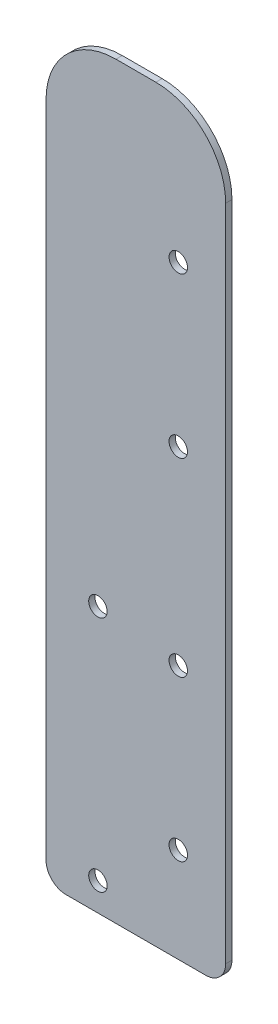
ISO-10303-21;
HEADER;
FILE_DESCRIPTION(('STEP AP214'),'2;1');
FILE_NAME('part.step','',(''),(''),'','','');
FILE_SCHEMA(('AUTOMOTIVE_DESIGN { 1 0 10303 214 1 1 1 1 }'));
ENDSEC;
DATA;
#1=APPLICATION_CONTEXT('core data for automotive mechanical design processes');
#2=APPLICATION_PROTOCOL_DEFINITION('international standard','automotive_design',2000,#1);
#3=PRODUCT_CONTEXT('',#1,'mechanical');
#4=PRODUCT('Part','Part','',(#3));
#5=PRODUCT_RELATED_PRODUCT_CATEGORY('part','',(#4));
#6=PRODUCT_DEFINITION_FORMATION('','',#4);
#7=PRODUCT_DEFINITION_CONTEXT('part definition',#1,'design');
#8=PRODUCT_DEFINITION('design','',#6,#7);
#9=PRODUCT_DEFINITION_SHAPE('','',#8);
#10=(LENGTH_UNIT() NAMED_UNIT(*) SI_UNIT(.MILLI.,.METRE.));
#11=(NAMED_UNIT(*) PLANE_ANGLE_UNIT() SI_UNIT($,.RADIAN.));
#12=(NAMED_UNIT(*) SI_UNIT($,.STERADIAN.) SOLID_ANGLE_UNIT());
#13=UNCERTAINTY_MEASURE_WITH_UNIT(LENGTH_MEASURE(1.E-05),#10,'distance_accuracy_value','');
#14=(GEOMETRIC_REPRESENTATION_CONTEXT(3) GLOBAL_UNCERTAINTY_ASSIGNED_CONTEXT((#13)) GLOBAL_UNIT_ASSIGNED_CONTEXT((#10,
#11,#12)) REPRESENTATION_CONTEXT('',''));
#15=CARTESIAN_POINT('',(0.,0.,0.));
#16=DIRECTION('',(0.,0.,1.));
#17=DIRECTION('',(1.,0.,0.));
#18=AXIS2_PLACEMENT_3D('',#15,#16,#17);
#19=CARTESIAN_POINT('',(40.64,5.07999999999999,1.6002));
#20=DIRECTION('',(0.,0.,1.));
#21=DIRECTION('',(1.,0.,0.));
#22=AXIS2_PLACEMENT_3D('',#19,#20,#21);
#23=PLANE('',#22);
#24=CARTESIAN_POINT('',(33.655,153.67,1.6002));
#25=DIRECTION('',(0.,0.,1.));
#26=DIRECTION('',(1.,0.,0.));
#27=AXIS2_PLACEMENT_3D('',#24,#25,#26);
#28=CIRCLE('',#27,2.3495);
#29=CARTESIAN_POINT('',(36.0045,153.67,1.6002));
#30=VERTEX_POINT('',#29);
#31=EDGE_CURVE('E211',#30,#30,#28,.T.);
#32=ORIENTED_EDGE('',*,*,#31,.F.);
#33=EDGE_LOOP('',(#32));
#34=FACE_BOUND('',#33,.T.);
#35=CARTESIAN_POINT('',(13.208,7.15102725040235,1.6002));
#36=DIRECTION('',(0.,0.,1.));
#37=DIRECTION('',(1.,0.,0.));
#38=AXIS2_PLACEMENT_3D('',#35,#36,#37);
#39=CIRCLE('',#38,2.3495);
#40=CARTESIAN_POINT('',(15.5575,7.15102725040235,1.6002));
#41=VERTEX_POINT('',#40);
#42=EDGE_CURVE('E199',#41,#41,#39,.T.);
#43=ORIENTED_EDGE('',*,*,#42,.F.);
#44=EDGE_LOOP('',(#43));
#45=FACE_BOUND('',#44,.T.);
#46=CARTESIAN_POINT('',(33.655,24.13,1.6002));
#47=DIRECTION('',(0.,0.,1.));
#48=DIRECTION('',(1.,0.,0.));
#49=AXIS2_PLACEMENT_3D('',#46,#47,#48);
#50=CIRCLE('',#49,2.34949999999999);
#51=CARTESIAN_POINT('',(36.0045,24.13,1.6002));
#52=VERTEX_POINT('',#51);
#53=EDGE_CURVE('E142',#52,#52,#50,.T.);
#54=ORIENTED_EDGE('',*,*,#53,.F.);
#55=EDGE_LOOP('',(#54));
#56=FACE_BOUND('',#55,.T.);
#57=DIRECTION('',(1.,0.,0.));
#58=VECTOR('',#57,1.);
#59=CARTESIAN_POINT('',(5.07001431390806,0.,1.6002));
#60=LINE('',#59,#58);
#61=CARTESIAN_POINT('',(5.07001431390807,0.,1.6002));
#62=VERTEX_POINT('',#61);
#63=CARTESIAN_POINT('',(40.64,0.,1.6002));
#64=VERTEX_POINT('',#63);
#65=EDGE_CURVE('E102',#62,#64,#60,.T.);
#66=ORIENTED_EDGE('',*,*,#65,.T.);
#67=CARTESIAN_POINT('',(40.64,5.07999999999999,1.6002));
#68=DIRECTION('',(0.,0.,1.));
#69=DIRECTION('',(1.,0.,0.));
#70=AXIS2_PLACEMENT_3D('',#67,#68,#69);
#71=CIRCLE('',#70,5.08);
#72=CARTESIAN_POINT('',(45.72,5.07999999999999,1.6002));
#73=VERTEX_POINT('',#72);
#74=EDGE_CURVE('E187',#64,#73,#71,.T.);
#75=ORIENTED_EDGE('',*,*,#74,.T.);
#76=DIRECTION('',(0.,1.,0.));
#77=VECTOR('',#76,1.);
#78=CARTESIAN_POINT('',(45.72,5.07999999999999,1.6002));
#79=LINE('',#78,#77);
#80=CARTESIAN_POINT('',(45.72,172.72,1.6002));
#81=VERTEX_POINT('',#80);
#82=EDGE_CURVE('E170',#73,#81,#79,.T.);
#83=ORIENTED_EDGE('',*,*,#82,.T.);
#84=CARTESIAN_POINT('',(27.94,172.72,1.6002));
#85=DIRECTION('',(0.,0.,1.));
#86=DIRECTION('',(1.,0.,0.));
#87=AXIS2_PLACEMENT_3D('',#84,#85,#86);
#88=CIRCLE('',#87,17.78);
#89=CARTESIAN_POINT('',(27.94,190.5,1.6002));
#90=VERTEX_POINT('',#89);
#91=EDGE_CURVE('E183',#81,#90,#88,.T.);
#92=ORIENTED_EDGE('',*,*,#91,.T.);
#93=DIRECTION('',(-1.,0.,0.));
#94=VECTOR('',#93,1.);
#95=CARTESIAN_POINT('',(17.78,190.5,1.6002));
#96=LINE('',#95,#94);
#97=CARTESIAN_POINT('',(17.78,190.5,1.6002));
#98=VERTEX_POINT('',#97);
#99=EDGE_CURVE('E122',#90,#98,#96,.T.);
#100=ORIENTED_EDGE('',*,*,#99,.T.);
#101=CARTESIAN_POINT('',(17.78,172.72,1.6002));
#102=DIRECTION('',(0.,0.,1.));
#103=DIRECTION('',(-1.,0.,0.));
#104=AXIS2_PLACEMENT_3D('',#101,#102,#103);
#105=CIRCLE('',#104,17.78);
#106=CARTESIAN_POINT('',(0.,172.72,1.6002));
#107=VERTEX_POINT('',#106);
#108=EDGE_CURVE('E116',#98,#107,#105,.T.);
#109=ORIENTED_EDGE('',*,*,#108,.T.);
#110=DIRECTION('',(0.,-1.,0.));
#111=VECTOR('',#110,1.);
#112=CARTESIAN_POINT('',(0.,4.76163722458914,1.6002));
#113=LINE('',#112,#111);
#114=CARTESIAN_POINT('',(0.,4.76163722458914,1.6002));
#115=VERTEX_POINT('',#114);
#116=EDGE_CURVE('E120',#107,#115,#113,.T.);
#117=ORIENTED_EDGE('',*,*,#116,.T.);
#118=CARTESIAN_POINT('',(5.07001431390807,5.08,1.6002));
#119=DIRECTION('',(0.,0.,1.));
#120=DIRECTION('',(-1.,0.,0.));
#121=AXIS2_PLACEMENT_3D('',#118,#119,#120);
#122=CIRCLE('',#121,5.08);
#123=EDGE_CURVE('E60',#115,#62,#122,.T.);
#124=ORIENTED_EDGE('',*,*,#123,.T.);
#125=EDGE_LOOP('',(#66,#75,#83,#92,#100,#109,#117,#124));
#126=FACE_BOUND('',#125,.T.);
#127=CARTESIAN_POINT('',(33.655,64.77,1.6002));
#128=DIRECTION('',(0.,0.,1.));
#129=DIRECTION('',(1.,0.,0.));
#130=AXIS2_PLACEMENT_3D('',#127,#128,#129);
#131=CIRCLE('',#130,2.34949999999999);
#132=CARTESIAN_POINT('',(36.0045,64.77,1.6002));
#133=VERTEX_POINT('',#132);
#134=EDGE_CURVE('E193',#133,#133,#131,.T.);
#135=ORIENTED_EDGE('',*,*,#134,.F.);
#136=EDGE_LOOP('',(#135));
#137=FACE_BOUND('',#136,.T.);
#138=CARTESIAN_POINT('',(33.655,113.03,1.6002));
#139=DIRECTION('',(0.,0.,1.));
#140=DIRECTION('',(1.,0.,0.));
#141=AXIS2_PLACEMENT_3D('',#138,#139,#140);
#142=CIRCLE('',#141,2.34949999999999);
#143=CARTESIAN_POINT('',(36.0045,113.03,1.6002));
#144=VERTEX_POINT('',#143);
#145=EDGE_CURVE('E205',#144,#144,#142,.T.);
#146=ORIENTED_EDGE('',*,*,#145,.F.);
#147=EDGE_LOOP('',(#146));
#148=FACE_BOUND('',#147,.T.);
#149=CARTESIAN_POINT('',(13.208,67.6031372950225,1.6002));
#150=DIRECTION('',(0.,0.,1.));
#151=DIRECTION('',(1.,0.,0.));
#152=AXIS2_PLACEMENT_3D('',#149,#150,#151);
#153=CIRCLE('',#152,2.3495);
#154=CARTESIAN_POINT('',(15.5575,67.6031372950225,1.6002));
#155=VERTEX_POINT('',#154);
#156=EDGE_CURVE('E217',#155,#155,#153,.T.);
#157=ORIENTED_EDGE('',*,*,#156,.F.);
#158=EDGE_LOOP('',(#157));
#159=FACE_BOUND('',#158,.T.);
#160=ADVANCED_FACE('F43',(#34,#45,#56,#126,#137,#148,#159),#23,.T.);
#161=CARTESIAN_POINT('',(40.64,5.07999999999999,0.));
#162=DIRECTION('',(0.,0.,1.));
#163=DIRECTION('',(1.,0.,0.));
#164=AXIS2_PLACEMENT_3D('',#161,#162,#163);
#165=PLANE('',#164);
#166=DIRECTION('',(1.,0.,0.));
#167=VECTOR('',#166,1.);
#168=CARTESIAN_POINT('',(40.64,0.,0.));
#169=LINE('',#168,#167);
#170=CARTESIAN_POINT('',(5.07001431390807,0.,0.));
#171=VERTEX_POINT('',#170);
#172=CARTESIAN_POINT('',(40.64,0.,0.));
#173=VERTEX_POINT('',#172);
#174=EDGE_CURVE('E96',#171,#173,#169,.T.);
#175=ORIENTED_EDGE('',*,*,#174,.F.);
#176=CARTESIAN_POINT('',(5.07001431390807,5.08,0.));
#177=DIRECTION('',(0.,0.,1.));
#178=DIRECTION('',(-1.,0.,0.));
#179=AXIS2_PLACEMENT_3D('',#176,#177,#178);
#180=CIRCLE('',#179,5.08);
#181=CARTESIAN_POINT('',(0.,4.76163722458914,0.));
#182=VERTEX_POINT('',#181);
#183=EDGE_CURVE('E152',#182,#171,#180,.T.);
#184=ORIENTED_EDGE('',*,*,#183,.F.);
#185=DIRECTION('',(0.,-1.,0.));
#186=VECTOR('',#185,1.);
#187=CARTESIAN_POINT('',(0.,4.76163722458914,0.));
#188=LINE('',#187,#186);
#189=CARTESIAN_POINT('',(0.,172.72,0.));
#190=VERTEX_POINT('',#189);
#191=EDGE_CURVE('E89',#190,#182,#188,.T.);
#192=ORIENTED_EDGE('',*,*,#191,.F.);
#193=CARTESIAN_POINT('',(17.78,172.72,0.));
#194=DIRECTION('',(0.,0.,1.));
#195=DIRECTION('',(-1.,0.,0.));
#196=AXIS2_PLACEMENT_3D('',#193,#194,#195);
#197=CIRCLE('',#196,17.78);
#198=CARTESIAN_POINT('',(17.78,190.5,0.));
#199=VERTEX_POINT('',#198);
#200=EDGE_CURVE('E130',#199,#190,#197,.T.);
#201=ORIENTED_EDGE('',*,*,#200,.F.);
#202=DIRECTION('',(-1.,0.,0.));
#203=VECTOR('',#202,1.);
#204=CARTESIAN_POINT('',(17.78,190.5,0.));
#205=LINE('',#204,#203);
#206=CARTESIAN_POINT('',(27.94,190.5,0.));
#207=VERTEX_POINT('',#206);
#208=EDGE_CURVE('E148',#207,#199,#205,.T.);
#209=ORIENTED_EDGE('',*,*,#208,.F.);
#210=CARTESIAN_POINT('',(27.94,172.72,0.));
#211=DIRECTION('',(0.,0.,1.));
#212=DIRECTION('',(1.,0.,0.));
#213=AXIS2_PLACEMENT_3D('',#210,#211,#212);
#214=CIRCLE('',#213,17.78);
#215=CARTESIAN_POINT('',(45.72,172.72,0.));
#216=VERTEX_POINT('',#215);
#217=EDGE_CURVE('E146',#216,#207,#214,.T.);
#218=ORIENTED_EDGE('',*,*,#217,.F.);
#219=DIRECTION('',(0.,1.,0.));
#220=VECTOR('',#219,1.);
#221=CARTESIAN_POINT('',(45.72,5.07999999999999,0.));
#222=LINE('',#221,#220);
#223=CARTESIAN_POINT('',(45.72,5.07999999999999,0.));
#224=VERTEX_POINT('',#223);
#225=EDGE_CURVE('E144',#224,#216,#222,.T.);
#226=ORIENTED_EDGE('',*,*,#225,.F.);
#227=CARTESIAN_POINT('',(40.64,5.07999999999999,0.));
#228=DIRECTION('',(0.,0.,1.));
#229=DIRECTION('',(1.,0.,0.));
#230=AXIS2_PLACEMENT_3D('',#227,#228,#229);
#231=CIRCLE('',#230,5.08);
#232=EDGE_CURVE('E141',#173,#224,#231,.T.);
#233=ORIENTED_EDGE('',*,*,#232,.F.);
#234=EDGE_LOOP('',(#175,#184,#192,#201,#209,#218,#226,#233));
#235=FACE_BOUND('',#234,.T.);
#236=CARTESIAN_POINT('',(33.655,24.13,0.));
#237=DIRECTION('',(0.,0.,1.));
#238=DIRECTION('',(1.,0.,0.));
#239=AXIS2_PLACEMENT_3D('',#236,#237,#238);
#240=CIRCLE('',#239,2.34949999999999);
#241=CARTESIAN_POINT('',(36.0045,24.13,0.));
#242=VERTEX_POINT('',#241);
#243=EDGE_CURVE('E190',#242,#242,#240,.T.);
#244=ORIENTED_EDGE('',*,*,#243,.T.);
#245=EDGE_LOOP('',(#244));
#246=FACE_BOUND('',#245,.T.);
#247=CARTESIAN_POINT('',(33.655,64.77,0.));
#248=DIRECTION('',(0.,0.,1.));
#249=DIRECTION('',(1.,0.,0.));
#250=AXIS2_PLACEMENT_3D('',#247,#248,#249);
#251=CIRCLE('',#250,2.34949999999999);
#252=CARTESIAN_POINT('',(36.0045,64.77,0.));
#253=VERTEX_POINT('',#252);
#254=EDGE_CURVE('E196',#253,#253,#251,.T.);
#255=ORIENTED_EDGE('',*,*,#254,.T.);
#256=EDGE_LOOP('',(#255));
#257=FACE_BOUND('',#256,.T.);
#258=CARTESIAN_POINT('',(13.208,7.15102725040235,0.));
#259=DIRECTION('',(0.,0.,1.));
#260=DIRECTION('',(1.,0.,0.));
#261=AXIS2_PLACEMENT_3D('',#258,#259,#260);
#262=CIRCLE('',#261,2.3495);
#263=CARTESIAN_POINT('',(15.5575,7.15102725040235,0.));
#264=VERTEX_POINT('',#263);
#265=EDGE_CURVE('E202',#264,#264,#262,.T.);
#266=ORIENTED_EDGE('',*,*,#265,.T.);
#267=EDGE_LOOP('',(#266));
#268=FACE_BOUND('',#267,.T.);
#269=CARTESIAN_POINT('',(33.655,113.03,0.));
#270=DIRECTION('',(0.,0.,1.));
#271=DIRECTION('',(1.,0.,0.));
#272=AXIS2_PLACEMENT_3D('',#269,#270,#271);
#273=CIRCLE('',#272,2.34949999999999);
#274=CARTESIAN_POINT('',(36.0045,113.03,0.));
#275=VERTEX_POINT('',#274);
#276=EDGE_CURVE('E208',#275,#275,#273,.T.);
#277=ORIENTED_EDGE('',*,*,#276,.T.);
#278=EDGE_LOOP('',(#277));
#279=FACE_BOUND('',#278,.T.);
#280=CARTESIAN_POINT('',(33.655,153.67,0.));
#281=DIRECTION('',(0.,0.,1.));
#282=DIRECTION('',(1.,0.,0.));
#283=AXIS2_PLACEMENT_3D('',#280,#281,#282);
#284=CIRCLE('',#283,2.3495);
#285=CARTESIAN_POINT('',(36.0045,153.67,0.));
#286=VERTEX_POINT('',#285);
#287=EDGE_CURVE('E214',#286,#286,#284,.T.);
#288=ORIENTED_EDGE('',*,*,#287,.T.);
#289=EDGE_LOOP('',(#288));
#290=FACE_BOUND('',#289,.T.);
#291=CARTESIAN_POINT('',(13.208,67.6031372950225,0.));
#292=DIRECTION('',(0.,0.,1.));
#293=DIRECTION('',(1.,0.,0.));
#294=AXIS2_PLACEMENT_3D('',#291,#292,#293);
#295=CIRCLE('',#294,2.3495);
#296=CARTESIAN_POINT('',(15.5575,67.6031372950225,0.));
#297=VERTEX_POINT('',#296);
#298=EDGE_CURVE('E220',#297,#297,#295,.T.);
#299=ORIENTED_EDGE('',*,*,#298,.T.);
#300=EDGE_LOOP('',(#299));
#301=FACE_BOUND('',#300,.T.);
#302=ADVANCED_FACE('F174',(#235,#246,#257,#268,#279,#290,#301),#165,.F.);
#303=CARTESIAN_POINT('',(40.64,0.,1.6002));
#304=DIRECTION('',(0.,1.,0.));
#305=DIRECTION('',(-1.,0.,0.));
#306=AXIS2_PLACEMENT_3D('',#303,#304,#305);
#307=PLANE('',#306);
#308=ORIENTED_EDGE('',*,*,#174,.T.);
#309=DIRECTION('',(0.,0.,-1.));
#310=VECTOR('',#309,1.);
#311=CARTESIAN_POINT('',(40.64,0.,1.6002));
#312=LINE('',#311,#310);
#313=EDGE_CURVE('E11',#64,#173,#312,.T.);
#314=ORIENTED_EDGE('',*,*,#313,.F.);
#315=ORIENTED_EDGE('',*,*,#65,.F.);
#316=DIRECTION('',(0.,0.,-1.));
#317=VECTOR('',#316,1.);
#318=CARTESIAN_POINT('',(5.07001431390807,0.,1.6002));
#319=LINE('',#318,#317);
#320=EDGE_CURVE('E136',#62,#171,#319,.T.);
#321=ORIENTED_EDGE('',*,*,#320,.T.);
#322=EDGE_LOOP('',(#308,#314,#315,#321));
#323=FACE_BOUND('',#322,.T.);
#324=ADVANCED_FACE('F45',(#323),#307,.F.);
#325=CARTESIAN_POINT('',(40.64,5.07999999999999,1.6002));
#326=DIRECTION('',(0.,0.,-1.));
#327=DIRECTION('',(-1.,0.,0.));
#328=AXIS2_PLACEMENT_3D('',#325,#326,#327);
#329=CYLINDRICAL_SURFACE('',#328,5.08);
#330=ORIENTED_EDGE('',*,*,#232,.T.);
#331=DIRECTION('',(0.,0.,-1.));
#332=VECTOR('',#331,1.);
#333=CARTESIAN_POINT('',(45.72,5.07999999999999,1.6002));
#334=LINE('',#333,#332);
#335=EDGE_CURVE('E52',#73,#224,#334,.T.);
#336=ORIENTED_EDGE('',*,*,#335,.F.);
#337=ORIENTED_EDGE('',*,*,#74,.F.);
#338=ORIENTED_EDGE('',*,*,#313,.T.);
#339=EDGE_LOOP('',(#330,#336,#337,#338));
#340=FACE_BOUND('',#339,.T.);
#341=ADVANCED_FACE('F255',(#340),#329,.T.);
#342=CARTESIAN_POINT('',(45.72,5.07999999999999,1.6002));
#343=DIRECTION('',(-1.,0.,0.));
#344=DIRECTION('',(0.,-1.,0.));
#345=AXIS2_PLACEMENT_3D('',#342,#343,#344);
#346=PLANE('',#345);
#347=ORIENTED_EDGE('',*,*,#225,.T.);
#348=DIRECTION('',(0.,0.,-1.));
#349=VECTOR('',#348,1.);
#350=CARTESIAN_POINT('',(45.72,172.72,1.6002));
#351=LINE('',#350,#349);
#352=EDGE_CURVE('E161',#81,#216,#351,.T.);
#353=ORIENTED_EDGE('',*,*,#352,.F.);
#354=ORIENTED_EDGE('',*,*,#82,.F.);
#355=ORIENTED_EDGE('',*,*,#335,.T.);
#356=EDGE_LOOP('',(#347,#353,#354,#355));
#357=FACE_BOUND('',#356,.T.);
#358=ADVANCED_FACE('F168',(#357),#346,.F.);
#359=CARTESIAN_POINT('',(27.94,172.72,1.6002));
#360=DIRECTION('',(0.,0.,-1.));
#361=DIRECTION('',(-1.,0.,0.));
#362=AXIS2_PLACEMENT_3D('',#359,#360,#361);
#363=CYLINDRICAL_SURFACE('',#362,17.78);
#364=ORIENTED_EDGE('',*,*,#217,.T.);
#365=DIRECTION('',(0.,0.,-1.));
#366=VECTOR('',#365,1.);
#367=CARTESIAN_POINT('',(27.94,190.5,1.6002));
#368=LINE('',#367,#366);
#369=EDGE_CURVE('E158',#90,#207,#368,.T.);
#370=ORIENTED_EDGE('',*,*,#369,.F.);
#371=ORIENTED_EDGE('',*,*,#91,.F.);
#372=ORIENTED_EDGE('',*,*,#352,.T.);
#373=EDGE_LOOP('',(#364,#370,#371,#372));
#374=FACE_BOUND('',#373,.T.);
#375=ADVANCED_FACE('F179',(#374),#363,.T.);
#376=CARTESIAN_POINT('',(17.78,190.5,1.6002));
#377=DIRECTION('',(0.,-1.,0.));
#378=DIRECTION('',(0.,0.,-1.));
#379=AXIS2_PLACEMENT_3D('',#376,#377,#378);
#380=PLANE('',#379);
#381=ORIENTED_EDGE('',*,*,#208,.T.);
#382=DIRECTION('',(0.,0.,-1.));
#383=VECTOR('',#382,1.);
#384=CARTESIAN_POINT('',(17.78,190.5,1.6002));
#385=LINE('',#384,#383);
#386=EDGE_CURVE('E131',#98,#199,#385,.T.);
#387=ORIENTED_EDGE('',*,*,#386,.F.);
#388=ORIENTED_EDGE('',*,*,#99,.F.);
#389=ORIENTED_EDGE('',*,*,#369,.T.);
#390=EDGE_LOOP('',(#381,#387,#388,#389));
#391=FACE_BOUND('',#390,.T.);
#392=ADVANCED_FACE('F182',(#391),#380,.F.);
#393=CARTESIAN_POINT('',(17.78,172.72,1.6002));
#394=DIRECTION('',(0.,0.,-1.));
#395=DIRECTION('',(-1.,0.,0.));
#396=AXIS2_PLACEMENT_3D('',#393,#394,#395);
#397=CYLINDRICAL_SURFACE('',#396,17.78);
#398=ORIENTED_EDGE('',*,*,#200,.T.);
#399=DIRECTION('',(0.,0.,-1.));
#400=VECTOR('',#399,1.);
#401=CARTESIAN_POINT('',(0.,172.72,1.6002));
#402=LINE('',#401,#400);
#403=EDGE_CURVE('E127',#107,#190,#402,.T.);
#404=ORIENTED_EDGE('',*,*,#403,.F.);
#405=ORIENTED_EDGE('',*,*,#108,.F.);
#406=ORIENTED_EDGE('',*,*,#386,.T.);
#407=EDGE_LOOP('',(#398,#404,#405,#406));
#408=FACE_BOUND('',#407,.T.);
#409=ADVANCED_FACE('F128',(#408),#397,.T.);
#410=CARTESIAN_POINT('',(0.,4.76163722458914,1.6002));
#411=DIRECTION('',(1.,0.,0.));
#412=DIRECTION('',(0.,0.,-1.));
#413=AXIS2_PLACEMENT_3D('',#410,#411,#412);
#414=PLANE('',#413);
#415=ORIENTED_EDGE('',*,*,#191,.T.);
#416=DIRECTION('',(0.,0.,-1.));
#417=VECTOR('',#416,1.);
#418=CARTESIAN_POINT('',(0.,4.76163722458914,1.6002));
#419=LINE('',#418,#417);
#420=EDGE_CURVE('E132',#115,#182,#419,.T.);
#421=ORIENTED_EDGE('',*,*,#420,.F.);
#422=ORIENTED_EDGE('',*,*,#116,.F.);
#423=ORIENTED_EDGE('',*,*,#403,.T.);
#424=EDGE_LOOP('',(#415,#421,#422,#423));
#425=FACE_BOUND('',#424,.T.);
#426=ADVANCED_FACE('F134',(#425),#414,.F.);
#427=CARTESIAN_POINT('',(5.07001431390807,5.08,1.6002));
#428=DIRECTION('',(0.,0.,-1.));
#429=DIRECTION('',(-1.,0.,0.));
#430=AXIS2_PLACEMENT_3D('',#427,#428,#429);
#431=CYLINDRICAL_SURFACE('',#430,5.08);
#432=ORIENTED_EDGE('',*,*,#183,.T.);
#433=ORIENTED_EDGE('',*,*,#320,.F.);
#434=ORIENTED_EDGE('',*,*,#123,.F.);
#435=ORIENTED_EDGE('',*,*,#420,.T.);
#436=EDGE_LOOP('',(#432,#433,#434,#435));
#437=FACE_BOUND('',#436,.T.);
#438=ADVANCED_FACE('F242',(#437),#431,.T.);
#439=CARTESIAN_POINT('',(33.655,24.13,1.6002));
#440=DIRECTION('',(0.,0.,-1.));
#441=DIRECTION('',(-1.,0.,0.));
#442=AXIS2_PLACEMENT_3D('',#439,#440,#441);
#443=CYLINDRICAL_SURFACE('',#442,2.34949999999999);
#444=ORIENTED_EDGE('',*,*,#53,.T.);
#445=EDGE_LOOP('',(#444));
#446=FACE_BOUND('',#445,.T.);
#447=ORIENTED_EDGE('',*,*,#243,.F.);
#448=EDGE_LOOP('',(#447));
#449=FACE_BOUND('',#448,.T.);
#450=ADVANCED_FACE('F239',(#446,#449),#443,.F.);
#451=CARTESIAN_POINT('',(33.655,64.77,1.6002));
#452=DIRECTION('',(0.,0.,-1.));
#453=DIRECTION('',(-1.,0.,0.));
#454=AXIS2_PLACEMENT_3D('',#451,#452,#453);
#455=CYLINDRICAL_SURFACE('',#454,2.34949999999999);
#456=ORIENTED_EDGE('',*,*,#134,.T.);
#457=EDGE_LOOP('',(#456));
#458=FACE_BOUND('',#457,.T.);
#459=ORIENTED_EDGE('',*,*,#254,.F.);
#460=EDGE_LOOP('',(#459));
#461=FACE_BOUND('',#460,.T.);
#462=ADVANCED_FACE('F319',(#458,#461),#455,.F.);
#463=CARTESIAN_POINT('',(13.208,7.15102725040235,1.6002));
#464=DIRECTION('',(0.,0.,-1.));
#465=DIRECTION('',(-1.,0.,0.));
#466=AXIS2_PLACEMENT_3D('',#463,#464,#465);
#467=CYLINDRICAL_SURFACE('',#466,2.3495);
#468=ORIENTED_EDGE('',*,*,#42,.T.);
#469=EDGE_LOOP('',(#468));
#470=FACE_BOUND('',#469,.T.);
#471=ORIENTED_EDGE('',*,*,#265,.F.);
#472=EDGE_LOOP('',(#471));
#473=FACE_BOUND('',#472,.T.);
#474=ADVANCED_FACE('F327',(#470,#473),#467,.F.);
#475=CARTESIAN_POINT('',(33.655,113.03,1.6002));
#476=DIRECTION('',(0.,0.,-1.));
#477=DIRECTION('',(-1.,0.,0.));
#478=AXIS2_PLACEMENT_3D('',#475,#476,#477);
#479=CYLINDRICAL_SURFACE('',#478,2.34949999999999);
#480=ORIENTED_EDGE('',*,*,#145,.T.);
#481=EDGE_LOOP('',(#480));
#482=FACE_BOUND('',#481,.T.);
#483=ORIENTED_EDGE('',*,*,#276,.F.);
#484=EDGE_LOOP('',(#483));
#485=FACE_BOUND('',#484,.T.);
#486=ADVANCED_FACE('F335',(#482,#485),#479,.F.);
#487=CARTESIAN_POINT('',(33.655,153.67,1.6002));
#488=DIRECTION('',(0.,0.,-1.));
#489=DIRECTION('',(-1.,0.,0.));
#490=AXIS2_PLACEMENT_3D('',#487,#488,#489);
#491=CYLINDRICAL_SURFACE('',#490,2.3495);
#492=ORIENTED_EDGE('',*,*,#31,.T.);
#493=EDGE_LOOP('',(#492));
#494=FACE_BOUND('',#493,.T.);
#495=ORIENTED_EDGE('',*,*,#287,.F.);
#496=EDGE_LOOP('',(#495));
#497=FACE_BOUND('',#496,.T.);
#498=ADVANCED_FACE('F344',(#494,#497),#491,.F.);
#499=CARTESIAN_POINT('',(13.208,67.6031372950225,1.6002));
#500=DIRECTION('',(0.,0.,-1.));
#501=DIRECTION('',(-1.,0.,0.));
#502=AXIS2_PLACEMENT_3D('',#499,#500,#501);
#503=CYLINDRICAL_SURFACE('',#502,2.3495);
#504=ORIENTED_EDGE('',*,*,#156,.T.);
#505=EDGE_LOOP('',(#504));
#506=FACE_BOUND('',#505,.T.);
#507=ORIENTED_EDGE('',*,*,#298,.F.);
#508=EDGE_LOOP('',(#507));
#509=FACE_BOUND('',#508,.T.);
#510=ADVANCED_FACE('F226',(#506,#509),#503,.F.);
#511=CLOSED_SHELL('',(#160,#302,#324,#341,#358,#375,#392,#409,#426,#438,#450,#462,#474,#486,
#498,#510));
#512=MANIFOLD_SOLID_BREP('B2',#511);
#513=ADVANCED_BREP_SHAPE_REPRESENTATION('',(#18,#512),#14);
#514=SHAPE_DEFINITION_REPRESENTATION(#9,#513);
ENDSEC;
END-ISO-10303-21;
